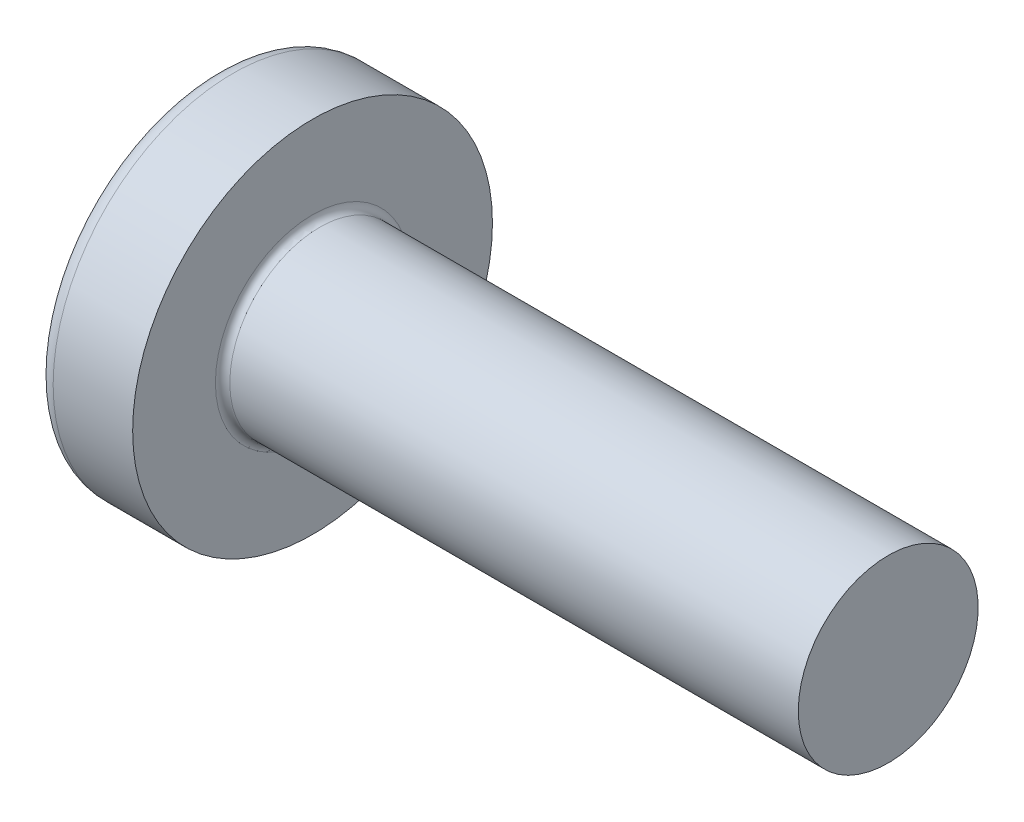
ISO-10303-21;
HEADER;
FILE_DESCRIPTION(('STEP AP214'),'2;1');
FILE_NAME('part.step','',(''),(''),'','','');
FILE_SCHEMA(('AUTOMOTIVE_DESIGN { 1 0 10303 214 1 1 1 1 }'));
ENDSEC;
DATA;
#1=APPLICATION_CONTEXT('core data for automotive mechanical design processes');
#2=APPLICATION_PROTOCOL_DEFINITION('international standard','automotive_design',2000,#1);
#3=PRODUCT_CONTEXT('',#1,'mechanical');
#4=PRODUCT('Part','Part','',(#3));
#5=PRODUCT_RELATED_PRODUCT_CATEGORY('part','',(#4));
#6=PRODUCT_DEFINITION_FORMATION('','',#4);
#7=PRODUCT_DEFINITION_CONTEXT('part definition',#1,'design');
#8=PRODUCT_DEFINITION('design','',#6,#7);
#9=PRODUCT_DEFINITION_SHAPE('','',#8);
#10=(LENGTH_UNIT() NAMED_UNIT(*) SI_UNIT(.MILLI.,.METRE.));
#11=(NAMED_UNIT(*) PLANE_ANGLE_UNIT() SI_UNIT($,.RADIAN.));
#12=(NAMED_UNIT(*) SI_UNIT($,.STERADIAN.) SOLID_ANGLE_UNIT());
#13=UNCERTAINTY_MEASURE_WITH_UNIT(LENGTH_MEASURE(1.E-05),#10,'distance_accuracy_value','');
#14=(GEOMETRIC_REPRESENTATION_CONTEXT(3) GLOBAL_UNCERTAINTY_ASSIGNED_CONTEXT((#13)) GLOBAL_UNIT_ASSIGNED_CONTEXT((#10,
#11,#12)) REPRESENTATION_CONTEXT('',''));
#15=CARTESIAN_POINT('',(0.,0.,0.));
#16=DIRECTION('',(0.,0.,1.));
#17=DIRECTION('',(1.,0.,0.));
#18=AXIS2_PLACEMENT_3D('',#15,#16,#17);
#19=CARTESIAN_POINT('',(4.,0.,0.));
#20=DIRECTION('',(-1.,0.,0.));
#21=DIRECTION('',(0.,1.,0.));
#22=AXIS2_PLACEMENT_3D('',#19,#20,#21);
#23=SPHERICAL_SURFACE('',#22,4.);
#24=CARTESIAN_POINT('',(0.803195914613464,0.,0.));
#25=DIRECTION('',(-1.,0.,0.));
#26=DIRECTION('',(0.,0.,1.));
#27=AXIS2_PLACEMENT_3D('',#24,#25,#26);
#28=CIRCLE('',#27,2.40425531914894);
#29=CARTESIAN_POINT('',(0.803195914613464,0.,2.40425531914894));
#30=VERTEX_POINT('',#29);
#31=EDGE_CURVE('E237',#30,#30,#28,.T.);
#32=ORIENTED_EDGE('',*,*,#31,.T.);
#33=EDGE_LOOP('',(#32));
#34=FACE_BOUND('',#33,.T.);
#35=CARTESIAN_POINT('',(0.0543400780062932,0.,0.));
#36=DIRECTION('',(1.,0.,0.));
#37=DIRECTION('',(0.,0.,-1.));
#38=AXIS2_PLACEMENT_3D('',#35,#36,#37);
#39=CIRCLE('',#38,0.657090389499513);
#40=CARTESIAN_POINT('',(0.0543400780062942,-0.369999999999998,-0.54301729251712));
#41=VERTEX_POINT('',#40);
#42=CARTESIAN_POINT('',(0.0543400780062936,-0.543017292517118,-0.37));
#43=VERTEX_POINT('',#42);
#44=EDGE_CURVE('E373',#41,#43,#39,.F.);
#45=ORIENTED_EDGE('',*,*,#44,.F.);
#46=CARTESIAN_POINT('',(4.,-0.37,0.));
#47=DIRECTION('',(0.,1.,0.));
#48=DIRECTION('',(0.,0.,1.));
#49=AXIS2_PLACEMENT_3D('',#46,#47,#48);
#50=CIRCLE('',#49,3.98285073785097);
#51=CARTESIAN_POINT('',(0.201999111211585,-0.369999999999996,-1.19928697514915));
#52=VERTEX_POINT('',#51);
#53=EDGE_CURVE('E299',#52,#41,#50,.T.);
#54=ORIENTED_EDGE('',*,*,#53,.F.);
#55=CARTESIAN_POINT('',(3.72274328891674,0.,0.556091024961349));
#56=DIRECTION('',(0.446197753347436,0.,-0.894934391398443));
#57=DIRECTION('',(-0.894934391398443,0.,-0.446197753347436));
#58=AXIS2_PLACEMENT_3D('',#55,#56,#57);
#59=CIRCLE('',#58,3.95144169742092);
#60=CARTESIAN_POINT('',(0.201999111211585,0.370000000000004,-1.19928697514915));
#61=VERTEX_POINT('',#60);
#62=EDGE_CURVE('E271',#52,#61,#59,.T.);
#63=ORIENTED_EDGE('',*,*,#62,.T.);
#64=CARTESIAN_POINT('',(4.,0.37,0.));
#65=DIRECTION('',(0.,-1.,0.));
#66=DIRECTION('',(0.,0.,-1.));
#67=AXIS2_PLACEMENT_3D('',#64,#65,#66);
#68=CIRCLE('',#67,3.98285073785097);
#69=CARTESIAN_POINT('',(0.0543400780062934,0.370000000000002,-0.543017292517118));
#70=VERTEX_POINT('',#69);
#71=EDGE_CURVE('E326',#70,#61,#68,.T.);
#72=ORIENTED_EDGE('',*,*,#71,.F.);
#73=CARTESIAN_POINT('',(0.0543400780062936,0.543017292517118,-0.37));
#74=VERTEX_POINT('',#73);
#75=EDGE_CURVE('E392',#74,#70,#39,.F.);
#76=ORIENTED_EDGE('',*,*,#75,.F.);
#77=CARTESIAN_POINT('',(4.,0.,-0.37));
#78=DIRECTION('',(0.,0.,1.));
#79=DIRECTION('',(1.,0.,0.));
#80=AXIS2_PLACEMENT_3D('',#77,#78,#79);
#81=CIRCLE('',#80,3.98285073785097);
#82=CARTESIAN_POINT('',(0.201999111211584,1.19928697514915,-0.37));
#83=VERTEX_POINT('',#82);
#84=EDGE_CURVE('E265',#83,#74,#81,.T.);
#85=ORIENTED_EDGE('',*,*,#84,.F.);
#86=CARTESIAN_POINT('',(3.72274328891674,-0.556091024961349,0.));
#87=DIRECTION('',(0.446197753347436,0.894934391398443,0.));
#88=DIRECTION('',(-0.894934391398443,0.446197753347436,0.));
#89=AXIS2_PLACEMENT_3D('',#86,#87,#88);
#90=CIRCLE('',#89,3.95144169742092);
#91=CARTESIAN_POINT('',(0.201999111211585,1.19928697514915,0.37));
#92=VERTEX_POINT('',#91);
#93=EDGE_CURVE('E268',#83,#92,#90,.T.);
#94=ORIENTED_EDGE('',*,*,#93,.T.);
#95=CARTESIAN_POINT('',(4.,0.,0.37));
#96=DIRECTION('',(0.,0.,-1.));
#97=DIRECTION('',(0.,1.,0.));
#98=AXIS2_PLACEMENT_3D('',#95,#96,#97);
#99=CIRCLE('',#98,3.98285073785097);
#100=CARTESIAN_POINT('',(0.0543400780062936,0.543017292517118,0.37));
#101=VERTEX_POINT('',#100);
#102=EDGE_CURVE('E261',#101,#92,#99,.T.);
#103=ORIENTED_EDGE('',*,*,#102,.F.);
#104=CARTESIAN_POINT('',(0.0543400780062942,0.369999999999998,0.54301729251712));
#105=VERTEX_POINT('',#104);
#106=EDGE_CURVE('E391',#105,#101,#39,.F.);
#107=ORIENTED_EDGE('',*,*,#106,.F.);
#108=CARTESIAN_POINT('',(0.201999111211584,0.369999999999996,1.19928697514916));
#109=VERTEX_POINT('',#108);
#110=EDGE_CURVE('E281',#109,#105,#68,.T.);
#111=ORIENTED_EDGE('',*,*,#110,.F.);
#112=CARTESIAN_POINT('',(3.72274328891674,0.,-0.556091024961349));
#113=DIRECTION('',(0.446197753347436,0.,0.894934391398443));
#114=DIRECTION('',(0.894934391398443,0.,-0.446197753347436));
#115=AXIS2_PLACEMENT_3D('',#112,#113,#114);
#116=CIRCLE('',#115,3.95144169742092);
#117=CARTESIAN_POINT('',(0.201999111211584,-0.370000000000004,1.19928697514915));
#118=VERTEX_POINT('',#117);
#119=EDGE_CURVE('E48',#109,#118,#116,.T.);
#120=ORIENTED_EDGE('',*,*,#119,.T.);
#121=CARTESIAN_POINT('',(0.0543400780062935,-0.370000000000002,0.543017292517118));
#122=VERTEX_POINT('',#121);
#123=EDGE_CURVE('E278',#122,#118,#50,.T.);
#124=ORIENTED_EDGE('',*,*,#123,.F.);
#125=CARTESIAN_POINT('',(0.0543400780062936,-0.543017292517118,0.37));
#126=VERTEX_POINT('',#125);
#127=EDGE_CURVE('E427',#126,#122,#39,.F.);
#128=ORIENTED_EDGE('',*,*,#127,.F.);
#129=CARTESIAN_POINT('',(0.201999111211585,-1.19928697514915,0.37));
#130=VERTEX_POINT('',#129);
#131=EDGE_CURVE('E262',#130,#126,#99,.T.);
#132=ORIENTED_EDGE('',*,*,#131,.F.);
#133=CARTESIAN_POINT('',(3.72274328891674,0.556091024961349,0.));
#134=DIRECTION('',(0.446197753347436,-0.894934391398443,0.));
#135=DIRECTION('',(0.894934391398443,0.446197753347436,0.));
#136=AXIS2_PLACEMENT_3D('',#133,#134,#135);
#137=CIRCLE('',#136,3.95144169742092);
#138=CARTESIAN_POINT('',(0.201999111211585,-1.19928697514915,-0.37));
#139=VERTEX_POINT('',#138);
#140=EDGE_CURVE('E258',#130,#139,#137,.T.);
#141=ORIENTED_EDGE('',*,*,#140,.T.);
#142=EDGE_CURVE('E63',#43,#139,#81,.T.);
#143=ORIENTED_EDGE('',*,*,#142,.F.);
#144=EDGE_LOOP('',(#45,#54,#63,#72,#76,#85,#94,#103,#107,#111,#120,#124,#128,#132,#141,#143));
#145=FACE_BOUND('',#144,.T.);
#146=ADVANCED_FACE('F35',(#34,#145),#23,.T.);
#147=CARTESIAN_POINT('',(1.5,0.552127712987655,-0.37));
#148=DIRECTION('',(0.,0.,1.));
#149=DIRECTION('',(1.,0.,0.));
#150=AXIS2_PLACEMENT_3D('',#147,#148,#149);
#151=PLANE('',#150);
#152=ORIENTED_EDGE('',*,*,#84,.T.);
#153=CARTESIAN_POINT('',(-0.98410748766867,0.628943903399942,-0.37));
#154=CARTESIAN_POINT('',(-0.783603343008974,0.612669947295736,-0.37));
#155=CARTESIAN_POINT('',(-0.583110931104086,0.596248129681141,-0.37));
#156=CARTESIAN_POINT('',(-0.182155788452108,0.562989164841715,-0.37));
#157=CARTESIAN_POINT('',(0.0183069414735531,0.546152007726029,-0.37));
#158=CARTESIAN_POINT('',(0.419186928470486,0.511943523152247,-0.37));
#159=CARTESIAN_POINT('',(0.61960418554543,0.4945721957373,-0.37));
#160=CARTESIAN_POINT('',(1.02037173794706,0.459102589125901,-0.37));
#161=CARTESIAN_POINT('',(1.22072203423871,0.441004320904958,-0.37));
#162=CARTESIAN_POINT('',(1.53631168775258,0.411665443099266,-0.37));
#163=CARTESIAN_POINT('',(1.65158348734209,0.400774467003839,-0.37));
#164=CARTESIAN_POINT('',(1.88208360561815,0.378547148308018,-0.37));
#165=CARTESIAN_POINT('',(1.99731192452822,0.367210808029326,-0.37));
#166=CARTESIAN_POINT('',(2.22771614129237,0.343963614894723,-0.37));
#167=CARTESIAN_POINT('',(2.34289203669079,0.332052737461392,-0.37));
#168=CARTESIAN_POINT('',(2.5731581934851,0.30741320876737,-0.37));
#169=CARTESIAN_POINT('',(2.68824845325022,0.294684542317204,-0.37));
#170=CARTESIAN_POINT('',(2.80327961663798,0.281425340988554,-0.37));
#171=B_SPLINE_CURVE_WITH_KNOTS('',3,(#153,#154,#155,#156,#157,#158,#159,#160,#161,#162,#163,
#164,#165,#166,#167,#168,#169,#170),.UNSPECIFIED.,.F.,.F.,(4,2,2,2,2,2,2,2,4),(0.,
0.603490856265068,1.20699609790343,1.81050129079257,2.41399737525255,2.7613521432415,
3.1087051006963,3.45607293033825,3.80344721379854),.UNSPECIFIED.);
#172=CARTESIAN_POINT('',(1.5,0.415013252800437,-0.370000000000001));
#173=VERTEX_POINT('',#172);
#174=EDGE_CURVE('E413',#74,#173,#171,.T.);
#175=ORIENTED_EDGE('',*,*,#174,.T.);
#176=DIRECTION('',(0.,1.,0.));
#177=VECTOR('',#176,1.);
#178=CARTESIAN_POINT('',(1.5,-0.552127712987656,-0.37));
#179=LINE('',#178,#177);
#180=CARTESIAN_POINT('',(1.5,0.552127712987655,-0.37));
#181=VERTEX_POINT('',#180);
#182=EDGE_CURVE('E355',#173,#181,#179,.T.);
#183=ORIENTED_EDGE('',*,*,#182,.T.);
#184=DIRECTION('',(0.894934391398443,-0.446197753347436,0.));
#185=VECTOR('',#184,1.);
#186=CARTESIAN_POINT('',(0.,1.3,-0.37));
#187=LINE('',#186,#185);
#188=EDGE_CURVE('E238',#83,#181,#187,.T.);
#189=ORIENTED_EDGE('',*,*,#188,.F.);
#190=EDGE_LOOP('',(#152,#175,#183,#189));
#191=FACE_BOUND('',#190,.T.);
#192=ADVANCED_FACE('F193',(#191),#151,.T.);
#193=CARTESIAN_POINT('',(1.5,-0.552127712987656,-0.37));
#194=VERTEX_POINT('',#193);
#195=CARTESIAN_POINT('',(1.5,-0.415013252800437,-0.370000000000001));
#196=VERTEX_POINT('',#195);
#197=EDGE_CURVE('E246',#194,#196,#179,.T.);
#198=ORIENTED_EDGE('',*,*,#197,.T.);
#199=CARTESIAN_POINT('',(-0.98410748766867,-0.628943903399942,-0.37));
#200=CARTESIAN_POINT('',(-0.783603343008974,-0.612669947295736,-0.37));
#201=CARTESIAN_POINT('',(-0.583110931104087,-0.596248129681141,-0.37));
#202=CARTESIAN_POINT('',(-0.182155788452109,-0.562989164841715,-0.37));
#203=CARTESIAN_POINT('',(0.0183069414735524,-0.546152007726029,-0.37));
#204=CARTESIAN_POINT('',(0.419186928470486,-0.511943523152247,-0.37));
#205=CARTESIAN_POINT('',(0.619604185545429,-0.4945721957373,-0.37));
#206=CARTESIAN_POINT('',(1.02037173794705,-0.4591025891259,-0.37));
#207=CARTESIAN_POINT('',(1.22072203423871,-0.441004320904958,-0.37));
#208=CARTESIAN_POINT('',(1.53631168775258,-0.411665443099266,-0.37));
#209=CARTESIAN_POINT('',(1.65158348734209,-0.400774467003839,-0.37));
#210=CARTESIAN_POINT('',(1.88208360561815,-0.378547148308018,-0.37));
#211=CARTESIAN_POINT('',(1.99731192452822,-0.367210808029325,-0.37));
#212=CARTESIAN_POINT('',(2.22771614129237,-0.343963614894723,-0.37));
#213=CARTESIAN_POINT('',(2.34289203669079,-0.332052737461392,-0.37));
#214=CARTESIAN_POINT('',(2.5731581934851,-0.30741320876737,-0.37));
#215=CARTESIAN_POINT('',(2.68824845325022,-0.294684542317204,-0.37));
#216=CARTESIAN_POINT('',(2.80327961663798,-0.281425340988554,-0.37));
#217=B_SPLINE_CURVE_WITH_KNOTS('',3,(#199,#200,#201,#202,#203,#204,#205,#206,#207,#208,#209,
#210,#211,#212,#213,#214,#215,#216),.UNSPECIFIED.,.F.,.F.,(4,2,2,2,2,2,2,2,4),(0.,
0.603490856265068,1.20699609790343,1.81050129079257,2.41399737525255,2.7613521432415,
3.1087051006963,3.45607293033825,3.80344721379854),.UNSPECIFIED.);
#218=EDGE_CURVE('E390',#196,#43,#217,.F.);
#219=ORIENTED_EDGE('',*,*,#218,.T.);
#220=ORIENTED_EDGE('',*,*,#142,.T.);
#221=DIRECTION('',(0.894934391398443,0.446197753347436,0.));
#222=VECTOR('',#221,1.);
#223=CARTESIAN_POINT('',(0.,-1.3,-0.37));
#224=LINE('',#223,#222);
#225=EDGE_CURVE('E329',#139,#194,#224,.T.);
#226=ORIENTED_EDGE('',*,*,#225,.T.);
#227=EDGE_LOOP('',(#198,#219,#220,#226));
#228=FACE_BOUND('',#227,.T.);
#229=ADVANCED_FACE('F199',(#228),#151,.T.);
#230=CARTESIAN_POINT('',(1.5,-0.552127712987656,0.37));
#231=DIRECTION('',(0.,0.,-1.));
#232=DIRECTION('',(0.,1.,0.));
#233=AXIS2_PLACEMENT_3D('',#230,#231,#232);
#234=PLANE('',#233);
#235=DIRECTION('',(0.,-1.,0.));
#236=VECTOR('',#235,1.);
#237=CARTESIAN_POINT('',(1.5,0.552127712987656,0.37));
#238=LINE('',#237,#236);
#239=CARTESIAN_POINT('',(1.5,0.552127712987655,0.37));
#240=VERTEX_POINT('',#239);
#241=CARTESIAN_POINT('',(1.5,0.415013252800437,0.370000000000001));
#242=VERTEX_POINT('',#241);
#243=EDGE_CURVE('E338',#240,#242,#238,.T.);
#244=ORIENTED_EDGE('',*,*,#243,.T.);
#245=CARTESIAN_POINT('',(-0.984107487670368,0.62894390340008,0.37));
#246=CARTESIAN_POINT('',(-0.783603343010498,0.61266994729586,0.37));
#247=CARTESIAN_POINT('',(-0.583110931105436,0.596248129681252,0.37));
#248=CARTESIAN_POINT('',(-0.18215578845311,0.562989164841799,0.37));
#249=CARTESIAN_POINT('',(0.0183069414727262,0.546152007726099,0.37));
#250=CARTESIAN_POINT('',(0.419186928470242,0.511943523152269,0.37));
#251=CARTESIAN_POINT('',(0.619604185545593,0.494572195737286,0.37));
#252=CARTESIAN_POINT('',(1.02037173794803,0.459102589125813,0.37));
#253=CARTESIAN_POINT('',(1.22072203424009,0.441004320904832,0.37));
#254=CARTESIAN_POINT('',(1.53631168775438,0.411665443099097,0.37));
#255=CARTESIAN_POINT('',(1.65158348734389,0.400774467003668,0.37));
#256=CARTESIAN_POINT('',(1.88208360561995,0.378547148307843,0.37));
#257=CARTESIAN_POINT('',(1.99731192453001,0.367210808029148,0.37));
#258=CARTESIAN_POINT('',(2.22771614129417,0.343963614894539,0.37));
#259=CARTESIAN_POINT('',(2.34289203669258,0.332052737461204,0.37));
#260=CARTESIAN_POINT('',(2.57315819348689,0.307413208767174,0.37));
#261=CARTESIAN_POINT('',(2.68824845325201,0.294684542317003,0.37));
#262=CARTESIAN_POINT('',(2.80327961663977,0.281425340988347,0.37));
#263=B_SPLINE_CURVE_WITH_KNOTS('',3,(#245,#246,#247,#248,#249,#250,#251,#252,#253,#254,#255,
#256,#257,#258,#259,#260,#261,#262),.UNSPECIFIED.,.F.,.F.,(4,2,2,2,2,2,2,2,4),(0.,
0.603490856265593,1.20699609790448,1.81050129079485,2.41399737525605,2.76135214324501,
3.1087051006998,3.45607293034176,3.80344721380205),.UNSPECIFIED.);
#264=EDGE_CURVE('E665',#242,#101,#263,.F.);
#265=ORIENTED_EDGE('',*,*,#264,.T.);
#266=ORIENTED_EDGE('',*,*,#102,.T.);
#267=DIRECTION('',(0.894934391398443,-0.446197753347436,0.));
#268=VECTOR('',#267,1.);
#269=CARTESIAN_POINT('',(0.,1.3,0.37));
#270=LINE('',#269,#268);
#271=EDGE_CURVE('E243',#92,#240,#270,.T.);
#272=ORIENTED_EDGE('',*,*,#271,.T.);
#273=EDGE_LOOP('',(#244,#265,#266,#272));
#274=FACE_BOUND('',#273,.T.);
#275=ADVANCED_FACE('F409',(#274),#234,.T.);
#276=ORIENTED_EDGE('',*,*,#131,.T.);
#277=CARTESIAN_POINT('',(-0.984107487670367,-0.628943903400079,0.37));
#278=CARTESIAN_POINT('',(-0.783603343010497,-0.61266994729586,0.37));
#279=CARTESIAN_POINT('',(-0.583110931105435,-0.596248129681252,0.37));
#280=CARTESIAN_POINT('',(-0.182155788453109,-0.562989164841799,0.37));
#281=CARTESIAN_POINT('',(0.018306941472727,-0.546152007726099,0.37));
#282=CARTESIAN_POINT('',(0.419186928470243,-0.511943523152269,0.37));
#283=CARTESIAN_POINT('',(0.619604185545594,-0.494572195737286,0.37));
#284=CARTESIAN_POINT('',(1.02037173794803,-0.459102589125813,0.37));
#285=CARTESIAN_POINT('',(1.2207220342401,-0.441004320904832,0.37));
#286=CARTESIAN_POINT('',(1.53631168775438,-0.411665443099097,0.37));
#287=CARTESIAN_POINT('',(1.65158348734389,-0.400774467003669,0.37));
#288=CARTESIAN_POINT('',(1.88208360561995,-0.378547148307843,0.37));
#289=CARTESIAN_POINT('',(1.99731192453001,-0.367210808029148,0.37));
#290=CARTESIAN_POINT('',(2.22771614129417,-0.343963614894539,0.37));
#291=CARTESIAN_POINT('',(2.34289203669258,-0.332052737461204,0.37));
#292=CARTESIAN_POINT('',(2.57315819348689,-0.307413208767175,0.37));
#293=CARTESIAN_POINT('',(2.68824845325201,-0.294684542317003,0.37));
#294=CARTESIAN_POINT('',(2.80327961663977,-0.281425340988347,0.37));
#295=B_SPLINE_CURVE_WITH_KNOTS('',3,(#277,#278,#279,#280,#281,#282,#283,#284,#285,#286,#287,
#288,#289,#290,#291,#292,#293,#294),.UNSPECIFIED.,.F.,.F.,(4,2,2,2,2,2,2,2,4),(0.,
0.603490856265593,1.20699609790448,1.81050129079485,2.41399737525605,2.76135214324501,
3.1087051006998,3.45607293034176,3.80344721380205),.UNSPECIFIED.);
#296=CARTESIAN_POINT('',(1.5,-0.415013252800437,0.370000000000001));
#297=VERTEX_POINT('',#296);
#298=EDGE_CURVE('E428',#126,#297,#295,.T.);
#299=ORIENTED_EDGE('',*,*,#298,.T.);
#300=CARTESIAN_POINT('',(1.5,-0.552127712987656,0.37));
#301=VERTEX_POINT('',#300);
#302=EDGE_CURVE('E340',#297,#301,#238,.T.);
#303=ORIENTED_EDGE('',*,*,#302,.T.);
#304=DIRECTION('',(0.894934391398443,0.446197753347436,0.));
#305=VECTOR('',#304,1.);
#306=CARTESIAN_POINT('',(0.,-1.3,0.37));
#307=LINE('',#306,#305);
#308=EDGE_CURVE('E331',#130,#301,#307,.T.);
#309=ORIENTED_EDGE('',*,*,#308,.F.);
#310=EDGE_LOOP('',(#276,#299,#303,#309));
#311=FACE_BOUND('',#310,.T.);
#312=ADVANCED_FACE('F513',(#311),#234,.T.);
#313=CARTESIAN_POINT('',(1.5,0.552127712987656,0.37));
#314=DIRECTION('',(0.446197753347436,0.894934391398443,0.));
#315=DIRECTION('',(-0.894934391398443,0.446197753347436,0.));
#316=AXIS2_PLACEMENT_3D('',#313,#314,#315);
#317=PLANE('',#316);
#318=CARTESIAN_POINT('',(2.47007552564217,0.0684659783631794,0.));
#319=DIRECTION('',(0.446197753347436,0.894934391398443,0.));
#320=DIRECTION('',(-0.894934391398443,0.446197753347436,0.));
#321=AXIS2_PLACEMENT_3D('',#318,#319,#320);
#322=ELLIPSE('',#321,1.0940568559235,0.483340636970288);
#323=CARTESIAN_POINT('',(1.5,0.552127712987657,0.0655056375514318));
#324=VERTEX_POINT('',#323);
#325=CARTESIAN_POINT('',(1.5,0.552127712987657,-0.0655056375514318));
#326=VERTEX_POINT('',#325);
#327=EDGE_CURVE('E304',#324,#326,#322,.F.);
#328=ORIENTED_EDGE('',*,*,#327,.F.);
#329=DIRECTION('',(0.,0.,-1.));
#330=VECTOR('',#329,1.);
#331=CARTESIAN_POINT('',(1.5,0.552127712987656,0.37));
#332=LINE('',#331,#330);
#333=EDGE_CURVE('E341',#240,#324,#332,.T.);
#334=ORIENTED_EDGE('',*,*,#333,.F.);
#335=ORIENTED_EDGE('',*,*,#271,.F.);
#336=ORIENTED_EDGE('',*,*,#93,.F.);
#337=ORIENTED_EDGE('',*,*,#188,.T.);
#338=EDGE_CURVE('E343',#326,#181,#332,.T.);
#339=ORIENTED_EDGE('',*,*,#338,.F.);
#340=EDGE_LOOP('',(#328,#334,#335,#336,#337,#339));
#341=FACE_BOUND('',#340,.T.);
#342=ADVANCED_FACE('F407',(#341),#317,.F.);
#343=CARTESIAN_POINT('',(0.,-1.3,-0.37));
#344=DIRECTION('',(0.446197753347436,-0.894934391398443,0.));
#345=DIRECTION('',(0.894934391398443,0.446197753347436,0.));
#346=AXIS2_PLACEMENT_3D('',#343,#344,#345);
#347=PLANE('',#346);
#348=CARTESIAN_POINT('',(2.47007552564217,-0.0684659783631794,0.));
#349=DIRECTION('',(0.446197753347436,-0.894934391398443,0.));
#350=DIRECTION('',(-0.894934391398443,-0.446197753347436,0.));
#351=AXIS2_PLACEMENT_3D('',#348,#349,#350);
#352=ELLIPSE('',#351,1.0940568559235,0.483340636970288);
#353=CARTESIAN_POINT('',(1.5,-0.552127712987657,-0.0655056375514327));
#354=VERTEX_POINT('',#353);
#355=CARTESIAN_POINT('',(1.5,-0.552127712987657,0.0655056375514325));
#356=VERTEX_POINT('',#355);
#357=EDGE_CURVE('E667',#354,#356,#352,.F.);
#358=ORIENTED_EDGE('',*,*,#357,.F.);
#359=DIRECTION('',(0.,0.,1.));
#360=VECTOR('',#359,1.);
#361=CARTESIAN_POINT('',(1.5,-0.552127712987656,-0.37));
#362=LINE('',#361,#360);
#363=EDGE_CURVE('E334',#194,#354,#362,.T.);
#364=ORIENTED_EDGE('',*,*,#363,.F.);
#365=ORIENTED_EDGE('',*,*,#225,.F.);
#366=ORIENTED_EDGE('',*,*,#140,.F.);
#367=ORIENTED_EDGE('',*,*,#308,.T.);
#368=EDGE_CURVE('E337',#356,#301,#362,.T.);
#369=ORIENTED_EDGE('',*,*,#368,.F.);
#370=EDGE_LOOP('',(#358,#364,#365,#366,#367,#369));
#371=FACE_BOUND('',#370,.T.);
#372=ADVANCED_FACE('F500',(#371),#347,.F.);
#373=CARTESIAN_POINT('',(1.5,0.552127712987656,-0.37));
#374=DIRECTION('',(-1.,0.,0.));
#375=DIRECTION('',(0.,0.,1.));
#376=AXIS2_PLACEMENT_3D('',#373,#374,#375);
#377=PLANE('',#376);
#378=DIRECTION('',(0.,1.,0.));
#379=VECTOR('',#378,1.);
#380=CARTESIAN_POINT('',(1.5,-0.370000000000002,0.552127712987654));
#381=LINE('',#380,#379);
#382=CARTESIAN_POINT('',(1.5,-0.370000000000002,0.552127712987654));
#383=VERTEX_POINT('',#382);
#384=CARTESIAN_POINT('',(1.5,-0.0655056375514445,0.552127712987656));
#385=VERTEX_POINT('',#384);
#386=EDGE_CURVE('E319',#383,#385,#381,.T.);
#387=ORIENTED_EDGE('',*,*,#386,.T.);
#388=CARTESIAN_POINT('',(1.5,0.,0.));
#389=DIRECTION('',(-1.,0.,0.));
#390=DIRECTION('',(0.,0.,1.));
#391=AXIS2_PLACEMENT_3D('',#388,#389,#390);
#392=CIRCLE('',#391,0.556);
#393=CARTESIAN_POINT('',(1.5,-0.370000000000001,0.415013252800436));
#394=VERTEX_POINT('',#393);
#395=EDGE_CURVE('E693',#394,#385,#392,.T.);
#396=ORIENTED_EDGE('',*,*,#395,.F.);
#397=DIRECTION('',(0.,0.,-1.));
#398=VECTOR('',#397,1.);
#399=CARTESIAN_POINT('',(1.5,-0.370000000000002,0.552127712987654));
#400=LINE('',#399,#398);
#401=EDGE_CURVE('E315',#383,#394,#400,.T.);
#402=ORIENTED_EDGE('',*,*,#401,.F.);
#403=EDGE_LOOP('',(#387,#396,#402));
#404=FACE_BOUND('',#403,.T.);
#405=ADVANCED_FACE('F493',(#404),#377,.T.);
#406=ORIENTED_EDGE('',*,*,#302,.F.);
#407=EDGE_CURVE('E698',#356,#297,#392,.T.);
#408=ORIENTED_EDGE('',*,*,#407,.F.);
#409=ORIENTED_EDGE('',*,*,#368,.T.);
#410=EDGE_LOOP('',(#406,#408,#409));
#411=FACE_BOUND('',#410,.T.);
#412=ADVANCED_FACE('F486',(#411),#377,.T.);
#413=ORIENTED_EDGE('',*,*,#363,.T.);
#414=EDGE_CURVE('E384',#196,#354,#392,.T.);
#415=ORIENTED_EDGE('',*,*,#414,.F.);
#416=ORIENTED_EDGE('',*,*,#197,.F.);
#417=EDGE_LOOP('',(#413,#415,#416));
#418=FACE_BOUND('',#417,.T.);
#419=ADVANCED_FACE('F480',(#418),#377,.T.);
#420=CARTESIAN_POINT('',(1.5,-0.369999999999998,-0.415013252800437));
#421=VERTEX_POINT('',#420);
#422=CARTESIAN_POINT('',(1.5,-0.369999999999998,-0.552127712987657));
#423=VERTEX_POINT('',#422);
#424=EDGE_CURVE('E318',#421,#423,#400,.T.);
#425=ORIENTED_EDGE('',*,*,#424,.F.);
#426=CARTESIAN_POINT('',(1.5,-0.0655056375514398,-0.552127712987656));
#427=VERTEX_POINT('',#426);
#428=EDGE_CURVE('E55',#427,#421,#392,.T.);
#429=ORIENTED_EDGE('',*,*,#428,.F.);
#430=DIRECTION('',(0.,-1.,0.));
#431=VECTOR('',#430,1.);
#432=CARTESIAN_POINT('',(1.5,0.370000000000002,-0.552127712987654));
#433=LINE('',#432,#431);
#434=EDGE_CURVE('E314',#427,#423,#433,.T.);
#435=ORIENTED_EDGE('',*,*,#434,.T.);
#436=EDGE_LOOP('',(#425,#429,#435));
#437=FACE_BOUND('',#436,.T.);
#438=ADVANCED_FACE('F379',(#437),#377,.T.);
#439=CARTESIAN_POINT('',(1.5,0.370000000000002,-0.552127712987654));
#440=VERTEX_POINT('',#439);
#441=CARTESIAN_POINT('',(1.5,0.0655056375514436,-0.552127712987656));
#442=VERTEX_POINT('',#441);
#443=EDGE_CURVE('E311',#440,#442,#433,.T.);
#444=ORIENTED_EDGE('',*,*,#443,.T.);
#445=CARTESIAN_POINT('',(1.5,0.370000000000001,-0.415013252800436));
#446=VERTEX_POINT('',#445);
#447=EDGE_CURVE('E383',#446,#442,#392,.T.);
#448=ORIENTED_EDGE('',*,*,#447,.F.);
#449=DIRECTION('',(0.,0.,1.));
#450=VECTOR('',#449,1.);
#451=CARTESIAN_POINT('',(1.5,0.370000000000002,-0.552127712987654));
#452=LINE('',#451,#450);
#453=EDGE_CURVE('E323',#440,#446,#452,.T.);
#454=ORIENTED_EDGE('',*,*,#453,.F.);
#455=EDGE_LOOP('',(#444,#448,#454));
#456=FACE_BOUND('',#455,.T.);
#457=ADVANCED_FACE('F468',(#456),#377,.T.);
#458=ORIENTED_EDGE('',*,*,#182,.F.);
#459=EDGE_CURVE('E682',#326,#173,#392,.T.);
#460=ORIENTED_EDGE('',*,*,#459,.F.);
#461=ORIENTED_EDGE('',*,*,#338,.T.);
#462=EDGE_LOOP('',(#458,#460,#461));
#463=FACE_BOUND('',#462,.T.);
#464=ADVANCED_FACE('F461',(#463),#377,.T.);
#465=ORIENTED_EDGE('',*,*,#333,.T.);
#466=EDGE_CURVE('E684',#242,#324,#392,.T.);
#467=ORIENTED_EDGE('',*,*,#466,.F.);
#468=ORIENTED_EDGE('',*,*,#243,.F.);
#469=EDGE_LOOP('',(#465,#467,#468));
#470=FACE_BOUND('',#469,.T.);
#471=ADVANCED_FACE('F455',(#470),#377,.T.);
#472=CARTESIAN_POINT('',(1.5,0.369999999999998,0.552127712987657));
#473=DIRECTION('',(0.,-1.,0.));
#474=DIRECTION('',(1.,0.,0.));
#475=AXIS2_PLACEMENT_3D('',#472,#473,#474);
#476=PLANE('',#475);
#477=ORIENTED_EDGE('',*,*,#110,.T.);
#478=CARTESIAN_POINT('',(-0.98410748766867,0.369999999999998,0.628943903399943));
#479=CARTESIAN_POINT('',(-0.783603343008974,0.369999999999998,0.612669947295737));
#480=CARTESIAN_POINT('',(-0.583110931104087,0.369999999999998,0.596248129681142));
#481=CARTESIAN_POINT('',(-0.182155788452109,0.369999999999998,0.562989164841716));
#482=CARTESIAN_POINT('',(0.0183069414735524,0.369999999999998,0.546152007726031));
#483=CARTESIAN_POINT('',(0.419186928470486,0.369999999999998,0.511943523152249));
#484=CARTESIAN_POINT('',(0.619604185545429,0.369999999999998,0.494572195737301));
#485=CARTESIAN_POINT('',(1.02037173794705,0.369999999999998,0.459102589125902));
#486=CARTESIAN_POINT('',(1.22072203423871,0.369999999999998,0.44100432090496));
#487=CARTESIAN_POINT('',(1.53631168775258,0.369999999999999,0.411665443099267));
#488=CARTESIAN_POINT('',(1.65158348734209,0.369999999999999,0.40077446700384));
#489=CARTESIAN_POINT('',(1.88208360561815,0.369999999999999,0.37854714830802));
#490=CARTESIAN_POINT('',(1.99731192452821,0.369999999999999,0.367210808029327));
#491=CARTESIAN_POINT('',(2.22771614129237,0.369999999999999,0.343963614894724));
#492=CARTESIAN_POINT('',(2.34289203669079,0.369999999999999,0.332052737461393));
#493=CARTESIAN_POINT('',(2.5731581934851,0.369999999999999,0.307413208767372));
#494=CARTESIAN_POINT('',(2.68824845325022,0.369999999999999,0.294684542317205));
#495=CARTESIAN_POINT('',(2.80327961663798,0.369999999999999,0.281425340988555));
#496=B_SPLINE_CURVE_WITH_KNOTS('',3,(#478,#479,#480,#481,#482,#483,#484,#485,#486,#487,#488,
#489,#490,#491,#492,#493,#494,#495),.UNSPECIFIED.,.F.,.F.,(4,2,2,2,2,2,2,2,4),(0.,
0.603490856265068,1.20699609790343,1.81050129079257,2.41399737525255,2.7613521432415,
3.1087051006963,3.45607293033825,3.80344721379854),.UNSPECIFIED.);
#497=CARTESIAN_POINT('',(1.5,0.369999999999999,0.415013252800439));
#498=VERTEX_POINT('',#497);
#499=EDGE_CURVE('E664',#105,#498,#496,.T.);
#500=ORIENTED_EDGE('',*,*,#499,.T.);
#501=CARTESIAN_POINT('',(1.5,0.369999999999998,0.552127712987657));
#502=VERTEX_POINT('',#501);
#503=EDGE_CURVE('E296',#498,#502,#452,.T.);
#504=ORIENTED_EDGE('',*,*,#503,.T.);
#505=DIRECTION('',(0.894934391398443,0.,-0.446197753347436));
#506=VECTOR('',#505,1.);
#507=CARTESIAN_POINT('',(0.,0.369999999999995,1.3));
#508=LINE('',#507,#506);
#509=EDGE_CURVE('E289',#109,#502,#508,.T.);
#510=ORIENTED_EDGE('',*,*,#509,.F.);
#511=EDGE_LOOP('',(#477,#500,#504,#510));
#512=FACE_BOUND('',#511,.T.);
#513=ADVANCED_FACE('F293',(#512),#476,.T.);
#514=CARTESIAN_POINT('',(1.5,-0.369999999999998,-0.552127712987657));
#515=DIRECTION('',(0.,1.,0.));
#516=DIRECTION('',(0.,0.,1.));
#517=AXIS2_PLACEMENT_3D('',#514,#515,#516);
#518=PLANE('',#517);
#519=ORIENTED_EDGE('',*,*,#401,.T.);
#520=CARTESIAN_POINT('',(-0.98410748766867,-0.370000000000002,0.62894390339994));
#521=CARTESIAN_POINT('',(-0.783603343008974,-0.370000000000002,0.612669947295734));
#522=CARTESIAN_POINT('',(-0.583110931104086,-0.370000000000002,0.596248129681139));
#523=CARTESIAN_POINT('',(-0.182155788452109,-0.370000000000002,0.562989164841714));
#524=CARTESIAN_POINT('',(0.0183069414735525,-0.370000000000002,0.546152007726028));
#525=CARTESIAN_POINT('',(0.419186928470486,-0.370000000000002,0.511943523152246));
#526=CARTESIAN_POINT('',(0.61960418554543,-0.370000000000002,0.494572195737299));
#527=CARTESIAN_POINT('',(1.02037173794706,-0.370000000000001,0.459102589125899));
#528=CARTESIAN_POINT('',(1.22072203423871,-0.370000000000001,0.441004320904957));
#529=CARTESIAN_POINT('',(1.53631168775258,-0.370000000000001,0.411665443099264));
#530=CARTESIAN_POINT('',(1.65158348734209,-0.370000000000001,0.400774467003838));
#531=CARTESIAN_POINT('',(1.88208360561815,-0.370000000000001,0.378547148308017));
#532=CARTESIAN_POINT('',(1.99731192452821,-0.370000000000001,0.367210808029324));
#533=CARTESIAN_POINT('',(2.22771614129237,-0.370000000000001,0.343963614894722));
#534=CARTESIAN_POINT('',(2.34289203669079,-0.370000000000001,0.332052737461391));
#535=CARTESIAN_POINT('',(2.5731581934851,-0.370000000000001,0.307413208767369));
#536=CARTESIAN_POINT('',(2.68824845325022,-0.370000000000001,0.294684542317202));
#537=CARTESIAN_POINT('',(2.80327961663798,-0.370000000000001,0.281425340988552));
#538=B_SPLINE_CURVE_WITH_KNOTS('',3,(#520,#521,#522,#523,#524,#525,#526,#527,#528,#529,#530,
#531,#532,#533,#534,#535,#536,#537),.UNSPECIFIED.,.F.,.F.,(4,2,2,2,2,2,2,2,4),(0.,
0.603490856265067,1.20699609790343,1.81050129079257,2.41399737525255,2.7613521432415,
3.1087051006963,3.45607293033825,3.80344721379854),.UNSPECIFIED.);
#539=EDGE_CURVE('E421',#394,#122,#538,.F.);
#540=ORIENTED_EDGE('',*,*,#539,.T.);
#541=ORIENTED_EDGE('',*,*,#123,.T.);
#542=DIRECTION('',(0.894934391398443,0.,-0.446197753347436));
#543=VECTOR('',#542,1.);
#544=CARTESIAN_POINT('',(0.,-0.370000000000005,1.3));
#545=LINE('',#544,#543);
#546=EDGE_CURVE('E291',#118,#383,#545,.T.);
#547=ORIENTED_EDGE('',*,*,#546,.T.);
#548=EDGE_LOOP('',(#519,#540,#541,#547));
#549=FACE_BOUND('',#548,.T.);
#550=ADVANCED_FACE('F228',(#549),#518,.T.);
#551=CARTESIAN_POINT('',(1.5,-0.370000000000002,0.552127712987654));
#552=DIRECTION('',(0.446197753347436,0.,0.894934391398443));
#553=DIRECTION('',(-0.894934391398443,0.,0.446197753347436));
#554=AXIS2_PLACEMENT_3D('',#551,#552,#553);
#555=PLANE('',#554);
#556=CARTESIAN_POINT('',(2.47007552564217,0.,0.0684659783631794));
#557=DIRECTION('',(0.446197753347436,0.,0.894934391398443));
#558=DIRECTION('',(-0.894934391398443,0.,0.446197753347436));
#559=AXIS2_PLACEMENT_3D('',#556,#557,#558);
#560=ELLIPSE('',#559,1.0940568559235,0.483340636970288);
#561=CARTESIAN_POINT('',(1.5,0.0655056375514406,0.552127712987656));
#562=VERTEX_POINT('',#561);
#563=EDGE_CURVE('E419',#385,#562,#560,.F.);
#564=ORIENTED_EDGE('',*,*,#563,.F.);
#565=ORIENTED_EDGE('',*,*,#386,.F.);
#566=ORIENTED_EDGE('',*,*,#546,.F.);
#567=ORIENTED_EDGE('',*,*,#119,.F.);
#568=ORIENTED_EDGE('',*,*,#509,.T.);
#569=EDGE_CURVE('E322',#562,#502,#381,.T.);
#570=ORIENTED_EDGE('',*,*,#569,.F.);
#571=EDGE_LOOP('',(#564,#565,#566,#567,#568,#570));
#572=FACE_BOUND('',#571,.T.);
#573=ADVANCED_FACE('F287',(#572),#555,.F.);
#574=CARTESIAN_POINT('',(0.,0.370000000000005,-1.3));
#575=DIRECTION('',(0.446197753347436,0.,-0.894934391398443));
#576=DIRECTION('',(0.894934391398443,0.,0.446197753347436));
#577=AXIS2_PLACEMENT_3D('',#574,#575,#576);
#578=PLANE('',#577);
#579=CARTESIAN_POINT('',(2.47007552564217,0.,-0.0684659783631795));
#580=DIRECTION('',(0.446197753347436,0.,-0.894934391398443));
#581=DIRECTION('',(-0.894934391398443,0.,-0.446197753347436));
#582=AXIS2_PLACEMENT_3D('',#579,#580,#581);
#583=ELLIPSE('',#582,1.0940568559235,0.483340636970288);
#584=EDGE_CURVE('E377',#442,#427,#583,.F.);
#585=ORIENTED_EDGE('',*,*,#584,.F.);
#586=ORIENTED_EDGE('',*,*,#443,.F.);
#587=DIRECTION('',(0.894934391398443,0.,0.446197753347436));
#588=VECTOR('',#587,1.);
#589=CARTESIAN_POINT('',(0.,0.370000000000005,-1.3));
#590=LINE('',#589,#588);
#591=EDGE_CURVE('E301',#61,#440,#590,.T.);
#592=ORIENTED_EDGE('',*,*,#591,.F.);
#593=ORIENTED_EDGE('',*,*,#62,.F.);
#594=DIRECTION('',(0.894934391398443,0.,0.446197753347436));
#595=VECTOR('',#594,1.);
#596=CARTESIAN_POINT('',(0.,-0.369999999999995,-1.3));
#597=LINE('',#596,#595);
#598=EDGE_CURVE('E308',#52,#423,#597,.T.);
#599=ORIENTED_EDGE('',*,*,#598,.T.);
#600=ORIENTED_EDGE('',*,*,#434,.F.);
#601=EDGE_LOOP('',(#585,#586,#592,#593,#599,#600));
#602=FACE_BOUND('',#601,.T.);
#603=ADVANCED_FACE('F368',(#602),#578,.F.);
#604=ORIENTED_EDGE('',*,*,#453,.T.);
#605=CARTESIAN_POINT('',(-0.984107487670367,0.370000000000002,-0.628943903400078));
#606=CARTESIAN_POINT('',(-0.783603343010497,0.370000000000002,-0.612669947295859));
#607=CARTESIAN_POINT('',(-0.583110931105435,0.370000000000002,-0.596248129681251));
#608=CARTESIAN_POINT('',(-0.182155788453109,0.370000000000002,-0.562989164841798));
#609=CARTESIAN_POINT('',(0.0183069414727269,0.370000000000002,-0.546152007726098));
#610=CARTESIAN_POINT('',(0.419186928470243,0.370000000000002,-0.511943523152268));
#611=CARTESIAN_POINT('',(0.619604185545594,0.370000000000002,-0.494572195737285));
#612=CARTESIAN_POINT('',(1.02037173794803,0.370000000000002,-0.459102589125812));
#613=CARTESIAN_POINT('',(1.2207220342401,0.370000000000001,-0.441004320904831));
#614=CARTESIAN_POINT('',(1.53631168775438,0.370000000000001,-0.411665443099096));
#615=CARTESIAN_POINT('',(1.65158348734389,0.370000000000001,-0.400774467003667));
#616=CARTESIAN_POINT('',(1.88208360561995,0.370000000000001,-0.378547148307842));
#617=CARTESIAN_POINT('',(1.99731192453001,0.370000000000001,-0.367210808029146));
#618=CARTESIAN_POINT('',(2.22771614129417,0.370000000000001,-0.343963614894538));
#619=CARTESIAN_POINT('',(2.34289203669258,0.370000000000001,-0.332052737461203));
#620=CARTESIAN_POINT('',(2.57315819348689,0.370000000000001,-0.307413208767173));
#621=CARTESIAN_POINT('',(2.68824845325201,0.370000000000001,-0.294684542317002));
#622=CARTESIAN_POINT('',(2.80327961663977,0.370000000000001,-0.281425340988346));
#623=B_SPLINE_CURVE_WITH_KNOTS('',3,(#605,#606,#607,#608,#609,#610,#611,#612,#613,#614,#615,
#616,#617,#618,#619,#620,#621,#622),.UNSPECIFIED.,.F.,.F.,(4,2,2,2,2,2,2,2,4),(0.,
0.603490856265593,1.20699609790448,1.81050129079485,2.41399737525605,2.76135214324501,
3.1087051006998,3.45607293034176,3.80344721380205),.UNSPECIFIED.);
#624=EDGE_CURVE('E364',#446,#70,#623,.F.);
#625=ORIENTED_EDGE('',*,*,#624,.T.);
#626=ORIENTED_EDGE('',*,*,#71,.T.);
#627=ORIENTED_EDGE('',*,*,#591,.T.);
#628=EDGE_LOOP('',(#604,#625,#626,#627));
#629=FACE_BOUND('',#628,.T.);
#630=ADVANCED_FACE('F226',(#629),#476,.T.);
#631=ORIENTED_EDGE('',*,*,#53,.T.);
#632=CARTESIAN_POINT('',(-0.98410748766867,-0.369999999999997,-0.628943903399943));
#633=CARTESIAN_POINT('',(-0.783603343008974,-0.369999999999998,-0.612669947295737));
#634=CARTESIAN_POINT('',(-0.583110931104087,-0.369999999999998,-0.596248129681142));
#635=CARTESIAN_POINT('',(-0.182155788452109,-0.369999999999998,-0.562989164841716));
#636=CARTESIAN_POINT('',(0.0183069414735524,-0.369999999999998,-0.546152007726031));
#637=CARTESIAN_POINT('',(0.419186928470486,-0.369999999999998,-0.511943523152249));
#638=CARTESIAN_POINT('',(0.619604185545429,-0.369999999999998,-0.494572195737301));
#639=CARTESIAN_POINT('',(1.02037173794705,-0.369999999999998,-0.459102589125902));
#640=CARTESIAN_POINT('',(1.22072203423871,-0.369999999999998,-0.44100432090496));
#641=CARTESIAN_POINT('',(1.53631168775258,-0.369999999999998,-0.411665443099267));
#642=CARTESIAN_POINT('',(1.65158348734209,-0.369999999999998,-0.40077446700384));
#643=CARTESIAN_POINT('',(1.88208360561815,-0.369999999999999,-0.37854714830802));
#644=CARTESIAN_POINT('',(1.99731192452822,-0.369999999999999,-0.367210808029327));
#645=CARTESIAN_POINT('',(2.22771614129237,-0.369999999999999,-0.343963614894724));
#646=CARTESIAN_POINT('',(2.34289203669079,-0.369999999999999,-0.332052737461393));
#647=CARTESIAN_POINT('',(2.5731581934851,-0.369999999999999,-0.307413208767372));
#648=CARTESIAN_POINT('',(2.68824845325022,-0.369999999999999,-0.294684542317205));
#649=CARTESIAN_POINT('',(2.80327961663798,-0.369999999999999,-0.281425340988555));
#650=B_SPLINE_CURVE_WITH_KNOTS('',3,(#632,#633,#634,#635,#636,#637,#638,#639,#640,#641,#642,
#643,#644,#645,#646,#647,#648,#649),.UNSPECIFIED.,.F.,.F.,(4,2,2,2,2,2,2,2,4),(0.,
0.603490856265068,1.20699609790343,1.81050129079257,2.41399737525255,2.7613521432415,
3.1087051006963,3.45607293033825,3.80344721379854),.UNSPECIFIED.);
#651=EDGE_CURVE('E11',#41,#421,#650,.T.);
#652=ORIENTED_EDGE('',*,*,#651,.T.);
#653=ORIENTED_EDGE('',*,*,#424,.T.);
#654=ORIENTED_EDGE('',*,*,#598,.F.);
#655=EDGE_LOOP('',(#631,#652,#653,#654));
#656=FACE_BOUND('',#655,.T.);
#657=ADVANCED_FACE('F221',(#656),#518,.T.);
#658=CARTESIAN_POINT('',(-25.4,0.,0.));
#659=DIRECTION('',(-1.,0.,0.));
#660=DIRECTION('',(0.,0.,1.));
#661=AXIS2_PLACEMENT_3D('',#658,#659,#660);
#662=CYLINDRICAL_SURFACE('',#661,1.25);
#663=CARTESIAN_POINT('',(2.2,0.,0.));
#664=DIRECTION('',(-1.,0.,0.));
#665=DIRECTION('',(0.,0.,1.));
#666=AXIS2_PLACEMENT_3D('',#663,#664,#665);
#667=CIRCLE('',#666,1.25);
#668=CARTESIAN_POINT('',(2.2,0.,1.25));
#669=VERTEX_POINT('',#668);
#670=EDGE_CURVE('E232',#669,#669,#667,.F.);
#671=ORIENTED_EDGE('',*,*,#670,.T.);
#672=EDGE_LOOP('',(#671));
#673=FACE_BOUND('',#672,.T.);
#674=CARTESIAN_POINT('',(10.1,0.,0.));
#675=DIRECTION('',(-1.,0.,0.));
#676=DIRECTION('',(0.,0.,1.));
#677=AXIS2_PLACEMENT_3D('',#674,#675,#676);
#678=CIRCLE('',#677,1.25);
#679=CARTESIAN_POINT('',(10.1,0.,1.25));
#680=VERTEX_POINT('',#679);
#681=EDGE_CURVE('E235',#680,#680,#678,.T.);
#682=ORIENTED_EDGE('',*,*,#681,.T.);
#683=EDGE_LOOP('',(#682));
#684=FACE_BOUND('',#683,.T.);
#685=ADVANCED_FACE('F218',(#673,#684),#662,.T.);
#686=CARTESIAN_POINT('',(2.1,1.25,0.));
#687=DIRECTION('',(-1.,0.,0.));
#688=DIRECTION('',(0.,0.,1.));
#689=AXIS2_PLACEMENT_3D('',#686,#687,#688);
#690=PLANE('',#689);
#691=CARTESIAN_POINT('',(2.1,0.,0.));
#692=DIRECTION('',(-1.,0.,0.));
#693=DIRECTION('',(0.,0.,1.));
#694=AXIS2_PLACEMENT_3D('',#691,#692,#693);
#695=CIRCLE('',#694,1.35);
#696=CARTESIAN_POINT('',(2.1,0.,1.35));
#697=VERTEX_POINT('',#696);
#698=EDGE_CURVE('E254',#697,#697,#695,.T.);
#699=ORIENTED_EDGE('',*,*,#698,.T.);
#700=EDGE_LOOP('',(#699));
#701=FACE_BOUND('',#700,.T.);
#702=CARTESIAN_POINT('',(2.1,0.,0.));
#703=DIRECTION('',(-1.,0.,0.));
#704=DIRECTION('',(0.,0.,1.));
#705=AXIS2_PLACEMENT_3D('',#702,#703,#704);
#706=CIRCLE('',#705,2.5);
#707=CARTESIAN_POINT('',(2.1,0.,2.5));
#708=VERTEX_POINT('',#707);
#709=EDGE_CURVE('E251',#708,#708,#706,.T.);
#710=ORIENTED_EDGE('',*,*,#709,.F.);
#711=EDGE_LOOP('',(#710));
#712=FACE_BOUND('',#711,.T.);
#713=ADVANCED_FACE('F215',(#701,#712),#690,.F.);
#714=CARTESIAN_POINT('',(-25.4,0.,0.));
#715=DIRECTION('',(-1.,0.,0.));
#716=DIRECTION('',(0.,0.,1.));
#717=AXIS2_PLACEMENT_3D('',#714,#715,#716);
#718=CYLINDRICAL_SURFACE('',#717,2.5);
#719=ORIENTED_EDGE('',*,*,#709,.T.);
#720=EDGE_LOOP('',(#719));
#721=FACE_BOUND('',#720,.T.);
#722=CARTESIAN_POINT('',(0.995004159736655,0.,0.));
#723=DIRECTION('',(-1.,0.,0.));
#724=DIRECTION('',(0.,0.,1.));
#725=AXIS2_PLACEMENT_3D('',#722,#723,#724);
#726=CIRCLE('',#725,2.5);
#727=CARTESIAN_POINT('',(0.995004159736655,0.,2.5));
#728=VERTEX_POINT('',#727);
#729=EDGE_CURVE('E240',#728,#728,#726,.T.);
#730=ORIENTED_EDGE('',*,*,#729,.F.);
#731=EDGE_LOOP('',(#730));
#732=FACE_BOUND('',#731,.T.);
#733=ADVANCED_FACE('F211',(#721,#732),#718,.T.);
#734=CARTESIAN_POINT('',(0.995004159736656,0.,0.));
#735=DIRECTION('',(-1.,0.,0.));
#736=DIRECTION('',(0.,0.,1.));
#737=AXIS2_PLACEMENT_3D('',#734,#735,#736);
#738=TOROIDAL_SURFACE('',#737,2.26,0.24);
#739=ORIENTED_EDGE('',*,*,#729,.T.);
#740=EDGE_LOOP('',(#739));
#741=FACE_BOUND('',#740,.T.);
#742=ORIENTED_EDGE('',*,*,#31,.F.);
#743=EDGE_LOOP('',(#742));
#744=FACE_BOUND('',#743,.T.);
#745=ADVANCED_FACE('F208',(#741,#744),#738,.T.);
#746=CARTESIAN_POINT('',(10.1,1.25,0.));
#747=DIRECTION('',(1.,0.,0.));
#748=DIRECTION('',(0.,0.,-1.));
#749=AXIS2_PLACEMENT_3D('',#746,#747,#748);
#750=PLANE('',#749);
#751=ORIENTED_EDGE('',*,*,#681,.F.);
#752=EDGE_LOOP('',(#751));
#753=FACE_BOUND('',#752,.T.);
#754=ADVANCED_FACE('F206',(#753),#750,.T.);
#755=CARTESIAN_POINT('',(2.2,0.,0.));
#756=DIRECTION('',(-1.,0.,0.));
#757=DIRECTION('',(0.,0.,1.));
#758=AXIS2_PLACEMENT_3D('',#755,#756,#757);
#759=TOROIDAL_SURFACE('',#758,1.35,0.1);
#760=ORIENTED_EDGE('',*,*,#670,.F.);
#761=EDGE_LOOP('',(#760));
#762=FACE_BOUND('',#761,.T.);
#763=ORIENTED_EDGE('',*,*,#698,.F.);
#764=EDGE_LOOP('',(#763));
#765=FACE_BOUND('',#764,.T.);
#766=ADVANCED_FACE('F37',(#762,#765),#759,.F.);
#767=ORIENTED_EDGE('',*,*,#503,.F.);
#768=EDGE_CURVE('E385',#562,#498,#392,.T.);
#769=ORIENTED_EDGE('',*,*,#768,.F.);
#770=ORIENTED_EDGE('',*,*,#569,.T.);
#771=EDGE_LOOP('',(#767,#769,#770));
#772=FACE_BOUND('',#771,.T.);
#773=ADVANCED_FACE('F462',(#772),#377,.T.);
#774=CARTESIAN_POINT('',(1.5,0.,0.));
#775=DIRECTION('',(-1.,0.,0.));
#776=DIRECTION('',(0.,0.,1.));
#777=AXIS2_PLACEMENT_3D('',#774,#775,#776);
#778=CONICAL_SURFACE('',#777,0.556,0.069813170079766);
#779=ORIENTED_EDGE('',*,*,#327,.T.);
#780=EDGE_CURVE('E679',#324,#326,#392,.T.);
#781=ORIENTED_EDGE('',*,*,#780,.F.);
#782=EDGE_LOOP('',(#779,#781));
#783=FACE_BOUND('',#782,.T.);
#784=ADVANCED_FACE('F190',(#783),#778,.F.);
#785=ORIENTED_EDGE('',*,*,#357,.T.);
#786=EDGE_CURVE('E699',#354,#356,#392,.T.);
#787=ORIENTED_EDGE('',*,*,#786,.F.);
#788=EDGE_LOOP('',(#785,#787));
#789=FACE_BOUND('',#788,.T.);
#790=ADVANCED_FACE('F595',(#789),#778,.F.);
#791=EDGE_CURVE('E387',#498,#242,#392,.T.);
#792=ORIENTED_EDGE('',*,*,#791,.F.);
#793=ORIENTED_EDGE('',*,*,#499,.F.);
#794=ORIENTED_EDGE('',*,*,#106,.T.);
#795=ORIENTED_EDGE('',*,*,#264,.F.);
#796=EDGE_LOOP('',(#792,#793,#794,#795));
#797=FACE_BOUND('',#796,.T.);
#798=ADVANCED_FACE('F601',(#797),#778,.F.);
#799=ORIENTED_EDGE('',*,*,#563,.T.);
#800=EDGE_CURVE('E388',#385,#562,#392,.T.);
#801=ORIENTED_EDGE('',*,*,#800,.F.);
#802=EDGE_LOOP('',(#799,#801));
#803=FACE_BOUND('',#802,.T.);
#804=ADVANCED_FACE('F608',(#803),#778,.F.);
#805=ORIENTED_EDGE('',*,*,#584,.T.);
#806=EDGE_CURVE('E380',#442,#427,#392,.T.);
#807=ORIENTED_EDGE('',*,*,#806,.F.);
#808=EDGE_LOOP('',(#805,#807));
#809=FACE_BOUND('',#808,.T.);
#810=ADVANCED_FACE('F615',(#809),#778,.F.);
#811=ORIENTED_EDGE('',*,*,#127,.T.);
#812=ORIENTED_EDGE('',*,*,#539,.F.);
#813=EDGE_CURVE('E695',#297,#394,#392,.T.);
#814=ORIENTED_EDGE('',*,*,#813,.F.);
#815=ORIENTED_EDGE('',*,*,#298,.F.);
#816=EDGE_LOOP('',(#811,#812,#814,#815));
#817=FACE_BOUND('',#816,.T.);
#818=ADVANCED_FACE('F622',(#817),#778,.F.);
#819=ORIENTED_EDGE('',*,*,#75,.T.);
#820=ORIENTED_EDGE('',*,*,#624,.F.);
#821=EDGE_CURVE('E685',#173,#446,#392,.T.);
#822=ORIENTED_EDGE('',*,*,#821,.F.);
#823=ORIENTED_EDGE('',*,*,#174,.F.);
#824=EDGE_LOOP('',(#819,#820,#822,#823));
#825=FACE_BOUND('',#824,.T.);
#826=ADVANCED_FACE('F188',(#825),#778,.F.);
#827=EDGE_CURVE('E381',#421,#196,#392,.T.);
#828=ORIENTED_EDGE('',*,*,#827,.F.);
#829=ORIENTED_EDGE('',*,*,#651,.F.);
#830=ORIENTED_EDGE('',*,*,#44,.T.);
#831=ORIENTED_EDGE('',*,*,#218,.F.);
#832=EDGE_LOOP('',(#828,#829,#830,#831));
#833=FACE_BOUND('',#832,.T.);
#834=ADVANCED_FACE('F183',(#833),#778,.F.);
#835=CARTESIAN_POINT('',(1.68065535110549,0.,0.));
#836=DIRECTION('',(-1.,0.,0.));
#837=DIRECTION('',(0.,0.,1.));
#838=AXIS2_PLACEMENT_3D('',#835,#836,#837);
#839=CONICAL_SURFACE('',#838,0.,1.25663706143592);
#840=ORIENTED_EDGE('',*,*,#768,.T.);
#841=ORIENTED_EDGE('',*,*,#791,.T.);
#842=ORIENTED_EDGE('',*,*,#466,.T.);
#843=ORIENTED_EDGE('',*,*,#780,.T.);
#844=ORIENTED_EDGE('',*,*,#459,.T.);
#845=ORIENTED_EDGE('',*,*,#821,.T.);
#846=ORIENTED_EDGE('',*,*,#447,.T.);
#847=ORIENTED_EDGE('',*,*,#806,.T.);
#848=ORIENTED_EDGE('',*,*,#428,.T.);
#849=ORIENTED_EDGE('',*,*,#827,.T.);
#850=ORIENTED_EDGE('',*,*,#414,.T.);
#851=ORIENTED_EDGE('',*,*,#786,.T.);
#852=ORIENTED_EDGE('',*,*,#407,.T.);
#853=ORIENTED_EDGE('',*,*,#813,.T.);
#854=ORIENTED_EDGE('',*,*,#395,.T.);
#855=ORIENTED_EDGE('',*,*,#800,.T.);
#856=EDGE_LOOP('',(#840,#841,#842,#843,#844,#845,#846,#847,#848,#849,#850,#851,#852,#853,#854,#855));
#857=FACE_BOUND('',#856,.T.);
#858=CARTESIAN_POINT('',(1.68065535110549,0.,0.));
#859=VERTEX_POINT('',#858);
#860=VERTEX_LOOP('',#859);
#861=FACE_BOUND('',#860,.T.);
#862=ADVANCED_FACE('F181',(#857,#861),#839,.F.);
#863=CLOSED_SHELL('',(#146,#192,#229,#275,#312,#342,#372,#405,#412,#419,#438,#457,#464,#471,
#513,#550,#573,#603,#630,#657,#685,#713,#733,#745,#754,#766,#773,#784,#790,#798,#804,#810,#818,
#826,#834,#862));
#864=MANIFOLD_SOLID_BREP('B2',#863);
#865=ADVANCED_BREP_SHAPE_REPRESENTATION('',(#18,#864),#14);
#866=SHAPE_DEFINITION_REPRESENTATION(#9,#865);
ENDSEC;
END-ISO-10303-21;
